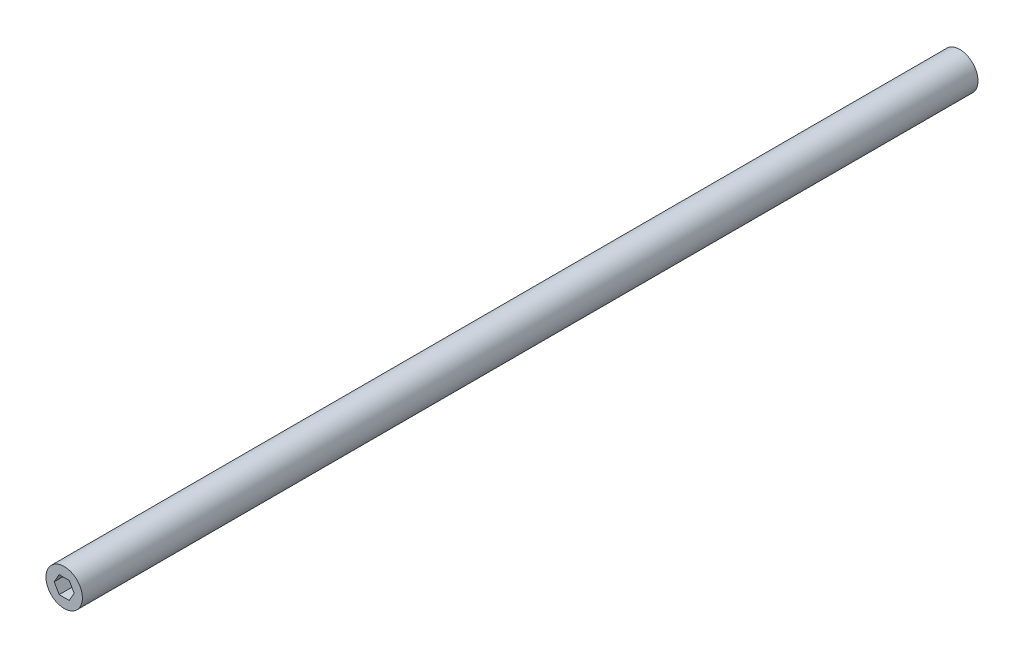
ISO-10303-21;
HEADER;
FILE_DESCRIPTION(('STEP AP214'),'2;1');
FILE_NAME('part.step','',(''),(''),'','','');
FILE_SCHEMA(('AUTOMOTIVE_DESIGN { 1 0 10303 214 1 1 1 1 }'));
ENDSEC;
DATA;
#1=APPLICATION_CONTEXT('core data for automotive mechanical design processes');
#2=APPLICATION_PROTOCOL_DEFINITION('international standard','automotive_design',2000,#1);
#3=PRODUCT_CONTEXT('',#1,'mechanical');
#4=PRODUCT('Part','Part','',(#3));
#5=PRODUCT_RELATED_PRODUCT_CATEGORY('part','',(#4));
#6=PRODUCT_DEFINITION_FORMATION('','',#4);
#7=PRODUCT_DEFINITION_CONTEXT('part definition',#1,'design');
#8=PRODUCT_DEFINITION('design','',#6,#7);
#9=PRODUCT_DEFINITION_SHAPE('','',#8);
#10=(LENGTH_UNIT() NAMED_UNIT(*) SI_UNIT(.MILLI.,.METRE.));
#11=(NAMED_UNIT(*) PLANE_ANGLE_UNIT() SI_UNIT($,.RADIAN.));
#12=(NAMED_UNIT(*) SI_UNIT($,.STERADIAN.) SOLID_ANGLE_UNIT());
#13=UNCERTAINTY_MEASURE_WITH_UNIT(LENGTH_MEASURE(1.E-05),#10,'distance_accuracy_value','');
#14=(GEOMETRIC_REPRESENTATION_CONTEXT(3) GLOBAL_UNCERTAINTY_ASSIGNED_CONTEXT((#13)) GLOBAL_UNIT_ASSIGNED_CONTEXT((#10,
#11,#12)) REPRESENTATION_CONTEXT('',''));
#15=CARTESIAN_POINT('',(0.,0.,0.));
#16=DIRECTION('',(0.,0.,1.));
#17=DIRECTION('',(1.,0.,0.));
#18=AXIS2_PLACEMENT_3D('',#15,#16,#17);
#19=CARTESIAN_POINT('',(-46.5732375594723,9.77124788012457,622.3));
#20=DIRECTION('',(0.,0.,1.));
#21=DIRECTION('',(1.,0.,0.));
#22=AXIS2_PLACEMENT_3D('',#19,#20,#21);
#23=PLANE('',#22);
#24=CARTESIAN_POINT('',(-46.5732375594723,9.77124788012457,622.3));
#25=DIRECTION('',(0.,0.,1.));
#26=DIRECTION('',(1.,0.,0.));
#27=AXIS2_PLACEMENT_3D('',#24,#25,#26);
#28=CIRCLE('',#27,12.6589518534255);
#29=CARTESIAN_POINT('',(-33.9142857060468,9.77124788012457,622.3));
#30=VERTEX_POINT('',#29);
#31=EDGE_CURVE('E11',#30,#30,#28,.T.);
#32=ORIENTED_EDGE('',*,*,#31,.T.);
#33=EDGE_LOOP('',(#32));
#34=FACE_BOUND('',#33,.T.);
#35=DIRECTION('',(-0.999999285576587,-0.00119534359711864,0.));
#36=VECTOR('',#35,1.);
#37=CARTESIAN_POINT('',(-43.1030747609234,15.7983727407622,622.3));
#38=LINE('',#37,#36);
#39=CARTESIAN_POINT('',(-43.1030747609234,15.7983727407622,622.3));
#40=VERTEX_POINT('',#39);
#41=CARTESIAN_POINT('',(-50.0577994012908,15.7900594492544,622.3));
#42=VERTEX_POINT('',#41);
#43=EDGE_CURVE('E102',#40,#42,#38,.T.);
#44=ORIENTED_EDGE('',*,*,#43,.F.);
#45=DIRECTION('',(-0.501034840709649,0.865427113277055,0.));
#46=VECTOR('',#45,1.);
#47=CARTESIAN_POINT('',(-39.6185129191049,9.77956117163236,622.3));
#48=LINE('',#47,#46);
#49=CARTESIAN_POINT('',(-39.6185129191049,9.77956117163236,622.3));
#50=VERTEX_POINT('',#49);
#51=EDGE_CURVE('E93',#50,#40,#48,.T.);
#52=ORIENTED_EDGE('',*,*,#51,.F.);
#53=DIRECTION('',(0.498964444866939,0.866622456874173,0.));
#54=VECTOR('',#53,1.);
#55=CARTESIAN_POINT('',(-43.0886757176538,3.75243631099474,622.3));
#56=LINE('',#55,#54);
#57=CARTESIAN_POINT('',(-43.0886757176538,3.75243631099474,622.3));
#58=VERTEX_POINT('',#57);
#59=EDGE_CURVE('E127',#58,#50,#56,.T.);
#60=ORIENTED_EDGE('',*,*,#59,.F.);
#61=DIRECTION('',(0.999999285576587,0.00119534359711814,0.));
#62=VECTOR('',#61,1.);
#63=CARTESIAN_POINT('',(-50.0434003580211,3.74412301948695,622.3));
#64=LINE('',#63,#62);
#65=CARTESIAN_POINT('',(-50.0434003580211,3.74412301948695,622.3));
#66=VERTEX_POINT('',#65);
#67=EDGE_CURVE('E124',#66,#58,#64,.T.);
#68=ORIENTED_EDGE('',*,*,#67,.F.);
#69=DIRECTION('',(0.50103484070965,-0.865427113277055,0.));
#70=VECTOR('',#69,1.);
#71=CARTESIAN_POINT('',(-53.5279621998396,9.76293458861677,622.3));
#72=LINE('',#71,#70);
#73=CARTESIAN_POINT('',(-53.5279621998396,9.76293458861677,622.3));
#74=VERTEX_POINT('',#73);
#75=EDGE_CURVE('E119',#74,#66,#72,.T.);
#76=ORIENTED_EDGE('',*,*,#75,.F.);
#77=DIRECTION('',(-0.498964444866938,-0.866622456874174,0.));
#78=VECTOR('',#77,1.);
#79=CARTESIAN_POINT('',(-50.0577994012908,15.7900594492544,622.3));
#80=LINE('',#79,#78);
#81=EDGE_CURVE('E115',#42,#74,#80,.T.);
#82=ORIENTED_EDGE('',*,*,#81,.F.);
#83=EDGE_LOOP('',(#44,#52,#60,#68,#76,#82));
#84=FACE_BOUND('',#83,.T.);
#85=ADVANCED_FACE('F39',(#34,#84),#23,.T.);
#86=CARTESIAN_POINT('',(-46.5732375594723,9.77124788012457,0.));
#87=DIRECTION('',(0.,0.,1.));
#88=DIRECTION('',(1.,0.,0.));
#89=AXIS2_PLACEMENT_3D('',#86,#87,#88);
#90=PLANE('',#89);
#91=CARTESIAN_POINT('',(-46.5732375594723,9.77124788012457,0.));
#92=DIRECTION('',(0.,0.,1.));
#93=DIRECTION('',(1.,0.,0.));
#94=AXIS2_PLACEMENT_3D('',#91,#92,#93);
#95=CIRCLE('',#94,12.6589518534255);
#96=CARTESIAN_POINT('',(-33.9142857060468,9.77124788012457,0.));
#97=VERTEX_POINT('',#96);
#98=EDGE_CURVE('E43',#97,#97,#95,.T.);
#99=ORIENTED_EDGE('',*,*,#98,.F.);
#100=EDGE_LOOP('',(#99));
#101=FACE_BOUND('',#100,.T.);
#102=DIRECTION('',(-0.501034840709649,0.865427113277055,0.));
#103=VECTOR('',#102,1.);
#104=CARTESIAN_POINT('',(-39.6185129191049,9.77956117163236,0.));
#105=LINE('',#104,#103);
#106=CARTESIAN_POINT('',(-39.6185129191049,9.77956117163236,0.));
#107=VERTEX_POINT('',#106);
#108=CARTESIAN_POINT('',(-43.1030747609234,15.7983727407622,0.));
#109=VERTEX_POINT('',#108);
#110=EDGE_CURVE('E63',#107,#109,#105,.T.);
#111=ORIENTED_EDGE('',*,*,#110,.T.);
#112=DIRECTION('',(-0.999999285576587,-0.00119534359711864,0.));
#113=VECTOR('',#112,1.);
#114=CARTESIAN_POINT('',(-43.1030747609234,15.7983727407622,0.));
#115=LINE('',#114,#113);
#116=CARTESIAN_POINT('',(-50.0577994012908,15.7900594492544,0.));
#117=VERTEX_POINT('',#116);
#118=EDGE_CURVE('E109',#109,#117,#115,.T.);
#119=ORIENTED_EDGE('',*,*,#118,.T.);
#120=DIRECTION('',(-0.498964444866938,-0.866622456874174,0.));
#121=VECTOR('',#120,1.);
#122=CARTESIAN_POINT('',(-50.0577994012908,15.7900594492544,0.));
#123=LINE('',#122,#121);
#124=CARTESIAN_POINT('',(-53.5279621998396,9.76293458861677,0.));
#125=VERTEX_POINT('',#124);
#126=EDGE_CURVE('E134',#117,#125,#123,.T.);
#127=ORIENTED_EDGE('',*,*,#126,.T.);
#128=DIRECTION('',(0.50103484070965,-0.865427113277055,0.));
#129=VECTOR('',#128,1.);
#130=CARTESIAN_POINT('',(-53.5279621998396,9.76293458861677,0.));
#131=LINE('',#130,#129);
#132=CARTESIAN_POINT('',(-50.0434003580211,3.74412301948695,0.));
#133=VERTEX_POINT('',#132);
#134=EDGE_CURVE('E138',#125,#133,#131,.T.);
#135=ORIENTED_EDGE('',*,*,#134,.T.);
#136=DIRECTION('',(0.999999285576587,0.00119534359711814,0.));
#137=VECTOR('',#136,1.);
#138=CARTESIAN_POINT('',(-50.0434003580211,3.74412301948695,0.));
#139=LINE('',#138,#137);
#140=CARTESIAN_POINT('',(-43.0886757176538,3.75243631099474,0.));
#141=VERTEX_POINT('',#140);
#142=EDGE_CURVE('E142',#133,#141,#139,.T.);
#143=ORIENTED_EDGE('',*,*,#142,.T.);
#144=DIRECTION('',(0.498964444866939,0.866622456874173,0.));
#145=VECTOR('',#144,1.);
#146=CARTESIAN_POINT('',(-43.0886757176538,3.75243631099474,0.));
#147=LINE('',#146,#145);
#148=EDGE_CURVE('E103',#141,#107,#147,.T.);
#149=ORIENTED_EDGE('',*,*,#148,.T.);
#150=EDGE_LOOP('',(#111,#119,#127,#135,#143,#149));
#151=FACE_BOUND('',#150,.T.);
#152=ADVANCED_FACE('F166',(#101,#151),#90,.F.);
#153=CARTESIAN_POINT('',(-46.5732375594723,9.77124788012457,622.3));
#154=DIRECTION('',(0.,0.,-1.));
#155=DIRECTION('',(-1.,0.,0.));
#156=AXIS2_PLACEMENT_3D('',#153,#154,#155);
#157=CYLINDRICAL_SURFACE('',#156,12.6589518534255);
#158=ORIENTED_EDGE('',*,*,#31,.F.);
#159=EDGE_LOOP('',(#158));
#160=FACE_BOUND('',#159,.T.);
#161=ORIENTED_EDGE('',*,*,#98,.T.);
#162=EDGE_LOOP('',(#161));
#163=FACE_BOUND('',#162,.T.);
#164=ADVANCED_FACE('F41',(#160,#163),#157,.T.);
#165=CARTESIAN_POINT('',(-39.6185129191049,9.77956117163236,622.3));
#166=DIRECTION('',(-0.865427113277055,-0.501034840709649,0.));
#167=DIRECTION('',(0.501034840709649,-0.865427113277055,0.));
#168=AXIS2_PLACEMENT_3D('',#165,#166,#167);
#169=PLANE('',#168);
#170=ORIENTED_EDGE('',*,*,#110,.F.);
#171=DIRECTION('',(0.,0.,-1.));
#172=VECTOR('',#171,1.);
#173=CARTESIAN_POINT('',(-39.6185129191049,9.77956117163236,622.3));
#174=LINE('',#173,#172);
#175=EDGE_CURVE('E97',#50,#107,#174,.T.);
#176=ORIENTED_EDGE('',*,*,#175,.F.);
#177=ORIENTED_EDGE('',*,*,#51,.T.);
#178=DIRECTION('',(0.,0.,-1.));
#179=VECTOR('',#178,1.);
#180=CARTESIAN_POINT('',(-43.1030747609234,15.7983727407622,622.3));
#181=LINE('',#180,#179);
#182=EDGE_CURVE('E96',#40,#109,#181,.T.);
#183=ORIENTED_EDGE('',*,*,#182,.T.);
#184=EDGE_LOOP('',(#170,#176,#177,#183));
#185=FACE_BOUND('',#184,.T.);
#186=ADVANCED_FACE('F95',(#185),#169,.T.);
#187=CARTESIAN_POINT('',(-43.1030747609234,15.7983727407622,622.3));
#188=DIRECTION('',(0.00119534359711864,-0.999999285576587,0.));
#189=DIRECTION('',(0.999999285576587,0.00119534359711864,0.));
#190=AXIS2_PLACEMENT_3D('',#187,#188,#189);
#191=PLANE('',#190);
#192=ORIENTED_EDGE('',*,*,#118,.F.);
#193=ORIENTED_EDGE('',*,*,#182,.F.);
#194=ORIENTED_EDGE('',*,*,#43,.T.);
#195=DIRECTION('',(0.,0.,-1.));
#196=VECTOR('',#195,1.);
#197=CARTESIAN_POINT('',(-50.0577994012908,15.7900594492544,622.3));
#198=LINE('',#197,#196);
#199=EDGE_CURVE('E111',#42,#117,#198,.T.);
#200=ORIENTED_EDGE('',*,*,#199,.T.);
#201=EDGE_LOOP('',(#192,#193,#194,#200));
#202=FACE_BOUND('',#201,.T.);
#203=ADVANCED_FACE('F106',(#202),#191,.T.);
#204=CARTESIAN_POINT('',(-50.0577994012908,15.7900594492544,622.3));
#205=DIRECTION('',(0.866622456874173,-0.498964444866938,0.));
#206=DIRECTION('',(0.498964444866938,0.866622456874174,0.));
#207=AXIS2_PLACEMENT_3D('',#204,#205,#206);
#208=PLANE('',#207);
#209=ORIENTED_EDGE('',*,*,#126,.F.);
#210=ORIENTED_EDGE('',*,*,#199,.F.);
#211=ORIENTED_EDGE('',*,*,#81,.T.);
#212=DIRECTION('',(0.,0.,-1.));
#213=VECTOR('',#212,1.);
#214=CARTESIAN_POINT('',(-53.5279621998396,9.76293458861677,622.3));
#215=LINE('',#214,#213);
#216=EDGE_CURVE('E156',#74,#125,#215,.T.);
#217=ORIENTED_EDGE('',*,*,#216,.T.);
#218=EDGE_LOOP('',(#209,#210,#211,#217));
#219=FACE_BOUND('',#218,.T.);
#220=ADVANCED_FACE('F162',(#219),#208,.T.);
#221=CARTESIAN_POINT('',(-53.5279621998396,9.76293458861677,622.3));
#222=DIRECTION('',(0.865427113277055,0.50103484070965,0.));
#223=DIRECTION('',(-0.50103484070965,0.865427113277055,0.));
#224=AXIS2_PLACEMENT_3D('',#221,#222,#223);
#225=PLANE('',#224);
#226=ORIENTED_EDGE('',*,*,#134,.F.);
#227=ORIENTED_EDGE('',*,*,#216,.F.);
#228=ORIENTED_EDGE('',*,*,#75,.T.);
#229=DIRECTION('',(0.,0.,-1.));
#230=VECTOR('',#229,1.);
#231=CARTESIAN_POINT('',(-50.0434003580211,3.74412301948695,622.3));
#232=LINE('',#231,#230);
#233=EDGE_CURVE('E153',#66,#133,#232,.T.);
#234=ORIENTED_EDGE('',*,*,#233,.T.);
#235=EDGE_LOOP('',(#226,#227,#228,#234));
#236=FACE_BOUND('',#235,.T.);
#237=ADVANCED_FACE('F174',(#236),#225,.T.);
#238=CARTESIAN_POINT('',(-50.0434003580211,3.74412301948695,622.3));
#239=DIRECTION('',(-0.00119534359711814,0.999999285576587,0.));
#240=DIRECTION('',(-0.999999285576587,-0.00119534359711814,0.));
#241=AXIS2_PLACEMENT_3D('',#238,#239,#240);
#242=PLANE('',#241);
#243=ORIENTED_EDGE('',*,*,#142,.F.);
#244=ORIENTED_EDGE('',*,*,#233,.F.);
#245=ORIENTED_EDGE('',*,*,#67,.T.);
#246=DIRECTION('',(0.,0.,-1.));
#247=VECTOR('',#246,1.);
#248=CARTESIAN_POINT('',(-43.0886757176538,3.75243631099474,622.3));
#249=LINE('',#248,#247);
#250=EDGE_CURVE('E55',#58,#141,#249,.T.);
#251=ORIENTED_EDGE('',*,*,#250,.T.);
#252=EDGE_LOOP('',(#243,#244,#245,#251));
#253=FACE_BOUND('',#252,.T.);
#254=ADVANCED_FACE('F172',(#253),#242,.T.);
#255=CARTESIAN_POINT('',(-43.0886757176538,3.75243631099474,622.3));
#256=DIRECTION('',(-0.866622456874173,0.498964444866939,0.));
#257=DIRECTION('',(-0.498964444866939,-0.866622456874173,0.));
#258=AXIS2_PLACEMENT_3D('',#255,#256,#257);
#259=PLANE('',#258);
#260=ORIENTED_EDGE('',*,*,#148,.F.);
#261=ORIENTED_EDGE('',*,*,#250,.F.);
#262=ORIENTED_EDGE('',*,*,#59,.T.);
#263=ORIENTED_EDGE('',*,*,#175,.T.);
#264=EDGE_LOOP('',(#260,#261,#262,#263));
#265=FACE_BOUND('',#264,.T.);
#266=ADVANCED_FACE('F168',(#265),#259,.T.);
#267=CLOSED_SHELL('',(#85,#152,#164,#186,#203,#220,#237,#254,#266));
#268=MANIFOLD_SOLID_BREP('B2',#267);
#269=ADVANCED_BREP_SHAPE_REPRESENTATION('',(#18,#268),#14);
#270=SHAPE_DEFINITION_REPRESENTATION(#9,#269);
ENDSEC;
END-ISO-10303-21;
